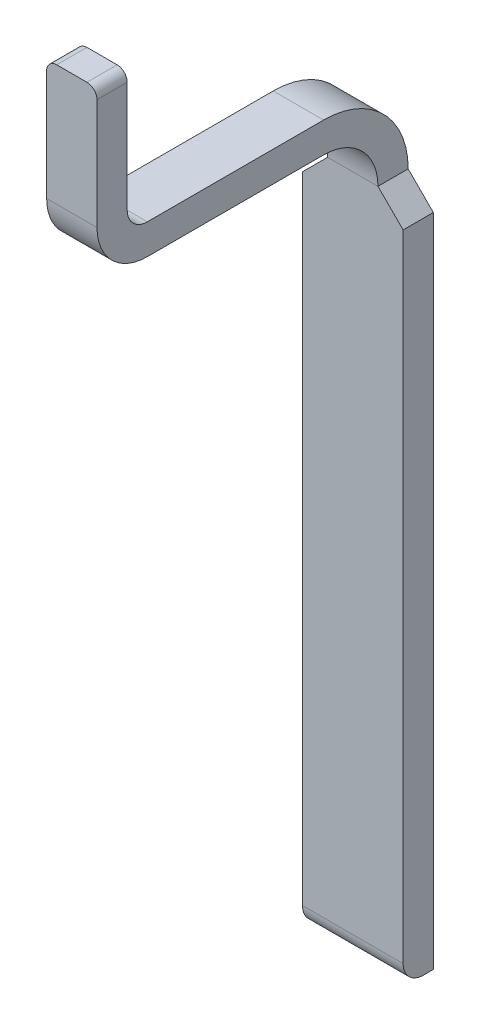
ISO-10303-21;
HEADER;
FILE_DESCRIPTION(('STEP AP214'),'2;1');
FILE_NAME('part.step','',(''),(''),'','','');
FILE_SCHEMA(('AUTOMOTIVE_DESIGN { 1 0 10303 214 1 1 1 1 }'));
ENDSEC;
DATA;
#1=APPLICATION_CONTEXT('core data for automotive mechanical design processes');
#2=APPLICATION_PROTOCOL_DEFINITION('international standard','automotive_design',2000,#1);
#3=PRODUCT_CONTEXT('',#1,'mechanical');
#4=PRODUCT('Part','Part','',(#3));
#5=PRODUCT_RELATED_PRODUCT_CATEGORY('part','',(#4));
#6=PRODUCT_DEFINITION_FORMATION('','',#4);
#7=PRODUCT_DEFINITION_CONTEXT('part definition',#1,'design');
#8=PRODUCT_DEFINITION('design','',#6,#7);
#9=PRODUCT_DEFINITION_SHAPE('','',#8);
#10=(LENGTH_UNIT() NAMED_UNIT(*) SI_UNIT(.MILLI.,.METRE.));
#11=(NAMED_UNIT(*) PLANE_ANGLE_UNIT() SI_UNIT($,.RADIAN.));
#12=(NAMED_UNIT(*) SI_UNIT($,.STERADIAN.) SOLID_ANGLE_UNIT());
#13=UNCERTAINTY_MEASURE_WITH_UNIT(LENGTH_MEASURE(1.E-05),#10,'distance_accuracy_value','');
#14=(GEOMETRIC_REPRESENTATION_CONTEXT(3) GLOBAL_UNCERTAINTY_ASSIGNED_CONTEXT((#13)) GLOBAL_UNIT_ASSIGNED_CONTEXT((#10,
#11,#12)) REPRESENTATION_CONTEXT('',''));
#15=CARTESIAN_POINT('',(0.,0.,0.));
#16=DIRECTION('',(0.,0.,1.));
#17=DIRECTION('',(1.,0.,0.));
#18=AXIS2_PLACEMENT_3D('',#15,#16,#17);
#19=CARTESIAN_POINT('',(-1.05,2.03,-0.12));
#20=DIRECTION('',(0.,0.,-1.));
#21=DIRECTION('',(-1.,0.,0.));
#22=AXIS2_PLACEMENT_3D('',#19,#20,#21);
#23=PLANE('',#22);
#24=DIRECTION('',(0.,-1.,0.));
#25=VECTOR('',#24,1.);
#26=CARTESIAN_POINT('',(-1.55,2.03,-0.12));
#27=LINE('',#26,#25);
#28=CARTESIAN_POINT('',(-1.55,1.905,-0.12));
#29=VERTEX_POINT('',#28);
#30=CARTESIAN_POINT('',(-1.55,-1.25,-0.120000000000002));
#31=VERTEX_POINT('',#30);
#32=EDGE_CURVE('E11',#29,#31,#27,.T.);
#33=ORIENTED_EDGE('',*,*,#32,.T.);
#34=DIRECTION('',(1.,0.,0.));
#35=VECTOR('',#34,1.);
#36=CARTESIAN_POINT('',(-1.05,-1.25,-0.120000000000002));
#37=LINE('',#36,#35);
#38=CARTESIAN_POINT('',(-1.05,-1.25,-0.120000000000002));
#39=VERTEX_POINT('',#38);
#40=EDGE_CURVE('E210',#31,#39,#37,.T.);
#41=ORIENTED_EDGE('',*,*,#40,.T.);
#42=DIRECTION('',(0.,-1.,0.));
#43=VECTOR('',#42,1.);
#44=CARTESIAN_POINT('',(-1.05,2.03,-0.12));
#45=LINE('',#44,#43);
#46=CARTESIAN_POINT('',(-1.05,1.905,-0.12));
#47=VERTEX_POINT('',#46);
#48=EDGE_CURVE('E27',#47,#39,#45,.T.);
#49=ORIENTED_EDGE('',*,*,#48,.F.);
#50=DIRECTION('',(-0.707106781186547,0.707106781186548,0.));
#51=VECTOR('',#50,1.);
#52=CARTESIAN_POINT('',(-1.05,1.905,-0.12));
#53=LINE('',#52,#51);
#54=CARTESIAN_POINT('',(-1.175,2.03,-0.12));
#55=VERTEX_POINT('',#54);
#56=EDGE_CURVE('E233',#47,#55,#53,.T.);
#57=ORIENTED_EDGE('',*,*,#56,.T.);
#58=DIRECTION('',(-1.,0.,0.));
#59=VECTOR('',#58,1.);
#60=CARTESIAN_POINT('',(-1.05,2.03,-0.12));
#61=LINE('',#60,#59);
#62=CARTESIAN_POINT('',(-1.425,2.03,-0.12));
#63=VERTEX_POINT('',#62);
#64=EDGE_CURVE('E218',#55,#63,#61,.T.);
#65=ORIENTED_EDGE('',*,*,#64,.T.);
#66=DIRECTION('',(-0.707106781186547,-0.707106781186548,0.));
#67=VECTOR('',#66,1.);
#68=CARTESIAN_POINT('',(-1.425,2.03,-0.12));
#69=LINE('',#68,#67);
#70=EDGE_CURVE('E241',#63,#29,#69,.T.);
#71=ORIENTED_EDGE('',*,*,#70,.T.);
#72=EDGE_LOOP('',(#33,#41,#49,#57,#65,#71));
#73=FACE_BOUND('',#72,.T.);
#74=ADVANCED_FACE('F16',(#73),#23,.F.);
#75=CARTESIAN_POINT('',(-1.55,-1.35,-0.27));
#76=DIRECTION('',(1.,0.,0.));
#77=DIRECTION('',(0.,-1.,0.));
#78=AXIS2_PLACEMENT_3D('',#75,#76,#77);
#79=PLANE('',#78);
#80=DIRECTION('',(0.,0.,-1.));
#81=VECTOR('',#80,1.);
#82=CARTESIAN_POINT('',(-1.55,-1.35,-0.120000000000002));
#83=LINE('',#82,#81);
#84=CARTESIAN_POINT('',(-1.55,-1.35,-0.22));
#85=VERTEX_POINT('',#84);
#86=CARTESIAN_POINT('',(-1.55,-1.35,-0.27));
#87=VERTEX_POINT('',#86);
#88=EDGE_CURVE('E148',#85,#87,#83,.T.);
#89=ORIENTED_EDGE('',*,*,#88,.F.);
#90=CARTESIAN_POINT('',(-1.55,-1.25,-0.22));
#91=DIRECTION('',(-1.,0.,0.));
#92=DIRECTION('',(0.,1.,0.));
#93=AXIS2_PLACEMENT_3D('',#90,#91,#92);
#94=CIRCLE('',#93,0.1);
#95=EDGE_CURVE('E207',#85,#31,#94,.T.);
#96=ORIENTED_EDGE('',*,*,#95,.T.);
#97=ORIENTED_EDGE('',*,*,#32,.F.);
#98=DIRECTION('',(0.,0.,-1.));
#99=VECTOR('',#98,1.);
#100=CARTESIAN_POINT('',(-1.55,1.905,-0.27));
#101=LINE('',#100,#99);
#102=CARTESIAN_POINT('',(-1.55,1.905,-0.27));
#103=VERTEX_POINT('',#102);
#104=EDGE_CURVE('E238',#29,#103,#101,.T.);
#105=ORIENTED_EDGE('',*,*,#104,.T.);
#106=DIRECTION('',(0.,1.,0.));
#107=VECTOR('',#106,1.);
#108=CARTESIAN_POINT('',(-1.55,-1.35,-0.27));
#109=LINE('',#108,#107);
#110=EDGE_CURVE('E253',#87,#103,#109,.T.);
#111=ORIENTED_EDGE('',*,*,#110,.F.);
#112=EDGE_LOOP('',(#89,#96,#97,#105,#111));
#113=FACE_BOUND('',#112,.T.);
#114=ADVANCED_FACE('F404',(#113),#79,.F.);
#115=CARTESIAN_POINT('',(-1.05,-1.35,-0.27));
#116=DIRECTION('',(1.,0.,0.));
#117=DIRECTION('',(0.,-1.,0.));
#118=AXIS2_PLACEMENT_3D('',#115,#116,#117);
#119=PLANE('',#118);
#120=ORIENTED_EDGE('',*,*,#48,.T.);
#121=CARTESIAN_POINT('',(-1.05,-1.25,-0.22));
#122=DIRECTION('',(1.,0.,0.));
#123=DIRECTION('',(0.,1.,0.));
#124=AXIS2_PLACEMENT_3D('',#121,#122,#123);
#125=CIRCLE('',#124,0.1);
#126=CARTESIAN_POINT('',(-1.05,-1.35,-0.22));
#127=VERTEX_POINT('',#126);
#128=EDGE_CURVE('E265',#39,#127,#125,.T.);
#129=ORIENTED_EDGE('',*,*,#128,.T.);
#130=DIRECTION('',(0.,0.,-1.));
#131=VECTOR('',#130,1.);
#132=CARTESIAN_POINT('',(-1.05,-1.35,-0.120000000000002));
#133=LINE('',#132,#131);
#134=CARTESIAN_POINT('',(-1.05,-1.35,-0.27));
#135=VERTEX_POINT('',#134);
#136=EDGE_CURVE('E274',#127,#135,#133,.T.);
#137=ORIENTED_EDGE('',*,*,#136,.T.);
#138=DIRECTION('',(0.,1.,0.));
#139=VECTOR('',#138,1.);
#140=CARTESIAN_POINT('',(-1.05,-1.35,-0.27));
#141=LINE('',#140,#139);
#142=CARTESIAN_POINT('',(-1.05,1.905,-0.27));
#143=VERTEX_POINT('',#142);
#144=EDGE_CURVE('E242',#135,#143,#141,.T.);
#145=ORIENTED_EDGE('',*,*,#144,.T.);
#146=DIRECTION('',(0.,0.,1.));
#147=VECTOR('',#146,1.);
#148=CARTESIAN_POINT('',(-1.05,1.905,-0.12));
#149=LINE('',#148,#147);
#150=EDGE_CURVE('E81',#143,#47,#149,.T.);
#151=ORIENTED_EDGE('',*,*,#150,.T.);
#152=EDGE_LOOP('',(#120,#129,#137,#145,#151));
#153=FACE_BOUND('',#152,.T.);
#154=ADVANCED_FACE('F418',(#153),#119,.T.);
#155=CARTESIAN_POINT('',(-1.175,2.03,0.149999999999998));
#156=DIRECTION('',(1.,0.,0.));
#157=DIRECTION('',(0.,0.,1.));
#158=AXIS2_PLACEMENT_3D('',#155,#156,#157);
#159=CYLINDRICAL_SURFACE('',#158,0.27);
#160=CARTESIAN_POINT('',(-1.425,2.03,0.149999999999998));
#161=DIRECTION('',(1.,0.,0.));
#162=DIRECTION('',(0.,-1.,0.));
#163=AXIS2_PLACEMENT_3D('',#160,#161,#162);
#164=CIRCLE('',#163,0.27);
#165=CARTESIAN_POINT('',(-1.425,2.3,0.149999999999998));
#166=VERTEX_POINT('',#165);
#167=EDGE_CURVE('E298',#63,#166,#164,.T.);
#168=ORIENTED_EDGE('',*,*,#167,.F.);
#169=ORIENTED_EDGE('',*,*,#64,.F.);
#170=CARTESIAN_POINT('',(-1.175,2.03,0.149999999999998));
#171=DIRECTION('',(1.,0.,0.));
#172=DIRECTION('',(0.,-1.,0.));
#173=AXIS2_PLACEMENT_3D('',#170,#171,#172);
#174=CIRCLE('',#173,0.27);
#175=CARTESIAN_POINT('',(-1.175,2.3,0.149999999999998));
#176=VERTEX_POINT('',#175);
#177=EDGE_CURVE('E191',#55,#176,#174,.T.);
#178=ORIENTED_EDGE('',*,*,#177,.T.);
#179=DIRECTION('',(-1.,0.,0.));
#180=VECTOR('',#179,1.);
#181=CARTESIAN_POINT('',(-1.175,2.3,0.149999999999998));
#182=LINE('',#181,#180);
#183=EDGE_CURVE('E181',#176,#166,#182,.T.);
#184=ORIENTED_EDGE('',*,*,#183,.T.);
#185=EDGE_LOOP('',(#168,#169,#178,#184));
#186=FACE_BOUND('',#185,.T.);
#187=ADVANCED_FACE('F18',(#186),#159,.F.);
#188=CARTESIAN_POINT('',(-1.175,2.3,0.149999999999998));
#189=DIRECTION('',(0.,-1.,0.));
#190=DIRECTION('',(0.,0.,-1.));
#191=AXIS2_PLACEMENT_3D('',#188,#189,#190);
#192=PLANE('',#191);
#193=DIRECTION('',(0.,0.,1.));
#194=VECTOR('',#193,1.);
#195=CARTESIAN_POINT('',(-1.425,2.3,0.149999999999998));
#196=LINE('',#195,#194);
#197=CARTESIAN_POINT('',(-1.425,2.3,1.025));
#198=VERTEX_POINT('',#197);
#199=EDGE_CURVE('E302',#166,#198,#196,.T.);
#200=ORIENTED_EDGE('',*,*,#199,.F.);
#201=ORIENTED_EDGE('',*,*,#183,.F.);
#202=DIRECTION('',(0.,0.,1.));
#203=VECTOR('',#202,1.);
#204=CARTESIAN_POINT('',(-1.175,2.3,0.149999999999998));
#205=LINE('',#204,#203);
#206=CARTESIAN_POINT('',(-1.175,2.3,1.025));
#207=VERTEX_POINT('',#206);
#208=EDGE_CURVE('E185',#176,#207,#205,.T.);
#209=ORIENTED_EDGE('',*,*,#208,.T.);
#210=DIRECTION('',(-1.,0.,0.));
#211=VECTOR('',#210,1.);
#212=CARTESIAN_POINT('',(-1.175,2.3,1.025));
#213=LINE('',#212,#211);
#214=EDGE_CURVE('E168',#207,#198,#213,.T.);
#215=ORIENTED_EDGE('',*,*,#214,.T.);
#216=EDGE_LOOP('',(#200,#201,#209,#215));
#217=FACE_BOUND('',#216,.T.);
#218=ADVANCED_FACE('F186',(#217),#192,.T.);
#219=CARTESIAN_POINT('',(-1.175,2.55,1.025));
#220=DIRECTION('',(1.,0.,0.));
#221=DIRECTION('',(0.,0.,1.));
#222=AXIS2_PLACEMENT_3D('',#219,#220,#221);
#223=CYLINDRICAL_SURFACE('',#222,0.25);
#224=CARTESIAN_POINT('',(-1.425,2.55,1.025));
#225=DIRECTION('',(-1.,0.,0.));
#226=DIRECTION('',(0.,1.,0.));
#227=AXIS2_PLACEMENT_3D('',#224,#225,#226);
#228=CIRCLE('',#227,0.25);
#229=CARTESIAN_POINT('',(-1.425,2.55,1.275));
#230=VERTEX_POINT('',#229);
#231=EDGE_CURVE('E176',#198,#230,#228,.T.);
#232=ORIENTED_EDGE('',*,*,#231,.F.);
#233=ORIENTED_EDGE('',*,*,#214,.F.);
#234=CARTESIAN_POINT('',(-1.175,2.55,1.025));
#235=DIRECTION('',(-1.,0.,0.));
#236=DIRECTION('',(0.,1.,0.));
#237=AXIS2_PLACEMENT_3D('',#234,#235,#236);
#238=CIRCLE('',#237,0.25);
#239=CARTESIAN_POINT('',(-1.175,2.55,1.275));
#240=VERTEX_POINT('',#239);
#241=EDGE_CURVE('E173',#207,#240,#238,.T.);
#242=ORIENTED_EDGE('',*,*,#241,.T.);
#243=DIRECTION('',(-1.,0.,0.));
#244=VECTOR('',#243,1.);
#245=CARTESIAN_POINT('',(-1.175,2.55,1.275));
#246=LINE('',#245,#244);
#247=EDGE_CURVE('E182',#240,#230,#246,.T.);
#248=ORIENTED_EDGE('',*,*,#247,.T.);
#249=EDGE_LOOP('',(#232,#233,#242,#248));
#250=FACE_BOUND('',#249,.T.);
#251=ADVANCED_FACE('F170',(#250),#223,.T.);
#252=CARTESIAN_POINT('',(-1.175,2.55,1.275));
#253=DIRECTION('',(0.,0.,1.));
#254=DIRECTION('',(0.,-1.,0.));
#255=AXIS2_PLACEMENT_3D('',#252,#253,#254);
#256=PLANE('',#255);
#257=DIRECTION('',(0.,1.,0.));
#258=VECTOR('',#257,1.);
#259=CARTESIAN_POINT('',(-1.175,2.55,1.275));
#260=LINE('',#259,#258);
#261=CARTESIAN_POINT('',(-1.175,3.1,1.275));
#262=VERTEX_POINT('',#261);
#263=EDGE_CURVE('E195',#240,#262,#260,.T.);
#264=ORIENTED_EDGE('',*,*,#263,.T.);
#265=CARTESIAN_POINT('',(-1.225,3.1,1.275));
#266=DIRECTION('',(0.,0.,1.));
#267=DIRECTION('',(0.,-1.,0.));
#268=AXIS2_PLACEMENT_3D('',#265,#266,#267);
#269=CIRCLE('',#268,0.05);
#270=CARTESIAN_POINT('',(-1.225,3.15,1.275));
#271=VERTEX_POINT('',#270);
#272=EDGE_CURVE('E271',#262,#271,#269,.T.);
#273=ORIENTED_EDGE('',*,*,#272,.T.);
#274=DIRECTION('',(-1.,0.,0.));
#275=VECTOR('',#274,1.);
#276=CARTESIAN_POINT('',(-1.175,3.15,1.275));
#277=LINE('',#276,#275);
#278=CARTESIAN_POINT('',(-1.375,3.15,1.275));
#279=VERTEX_POINT('',#278);
#280=EDGE_CURVE('E229',#271,#279,#277,.T.);
#281=ORIENTED_EDGE('',*,*,#280,.T.);
#282=CARTESIAN_POINT('',(-1.375,3.1,1.275));
#283=DIRECTION('',(0.,0.,1.));
#284=DIRECTION('',(0.,-1.,0.));
#285=AXIS2_PLACEMENT_3D('',#282,#283,#284);
#286=CIRCLE('',#285,0.05);
#287=CARTESIAN_POINT('',(-1.425,3.1,1.275));
#288=VERTEX_POINT('',#287);
#289=EDGE_CURVE('E220',#279,#288,#286,.T.);
#290=ORIENTED_EDGE('',*,*,#289,.T.);
#291=DIRECTION('',(0.,1.,0.));
#292=VECTOR('',#291,1.);
#293=CARTESIAN_POINT('',(-1.425,2.55,1.275));
#294=LINE('',#293,#292);
#295=EDGE_CURVE('E313',#230,#288,#294,.T.);
#296=ORIENTED_EDGE('',*,*,#295,.F.);
#297=ORIENTED_EDGE('',*,*,#247,.F.);
#298=EDGE_LOOP('',(#264,#273,#281,#290,#296,#297));
#299=FACE_BOUND('',#298,.T.);
#300=ADVANCED_FACE('F370',(#299),#256,.T.);
#301=CARTESIAN_POINT('',(-1.175,3.15,1.275));
#302=DIRECTION('',(0.,1.,0.));
#303=DIRECTION('',(1.,0.,0.));
#304=AXIS2_PLACEMENT_3D('',#301,#302,#303);
#305=PLANE('',#304);
#306=ORIENTED_EDGE('',*,*,#280,.F.);
#307=DIRECTION('',(0.,0.,-1.));
#308=VECTOR('',#307,1.);
#309=CARTESIAN_POINT('',(-1.225,3.15,1.275));
#310=LINE('',#309,#308);
#311=CARTESIAN_POINT('',(-1.225,3.15,1.125));
#312=VERTEX_POINT('',#311);
#313=EDGE_CURVE('E251',#271,#312,#310,.T.);
#314=ORIENTED_EDGE('',*,*,#313,.T.);
#315=DIRECTION('',(-1.,0.,0.));
#316=VECTOR('',#315,1.);
#317=CARTESIAN_POINT('',(-1.175,3.15,1.125));
#318=LINE('',#317,#316);
#319=CARTESIAN_POINT('',(-1.375,3.15,1.125));
#320=VERTEX_POINT('',#319);
#321=EDGE_CURVE('E232',#312,#320,#318,.T.);
#322=ORIENTED_EDGE('',*,*,#321,.T.);
#323=DIRECTION('',(0.,0.,1.));
#324=VECTOR('',#323,1.);
#325=CARTESIAN_POINT('',(-1.375,3.15,1.275));
#326=LINE('',#325,#324);
#327=EDGE_CURVE('E224',#320,#279,#326,.T.);
#328=ORIENTED_EDGE('',*,*,#327,.T.);
#329=EDGE_LOOP('',(#306,#314,#322,#328));
#330=FACE_BOUND('',#329,.T.);
#331=ADVANCED_FACE('F360',(#330),#305,.T.);
#332=CARTESIAN_POINT('',(-1.175,2.55,1.125));
#333=DIRECTION('',(0.,0.,-1.));
#334=DIRECTION('',(0.,-1.,0.));
#335=AXIS2_PLACEMENT_3D('',#332,#333,#334);
#336=PLANE('',#335);
#337=ORIENTED_EDGE('',*,*,#321,.F.);
#338=CARTESIAN_POINT('',(-1.225,3.1,1.125));
#339=DIRECTION('',(0.,0.,-1.));
#340=DIRECTION('',(0.,1.,0.));
#341=AXIS2_PLACEMENT_3D('',#338,#339,#340);
#342=CIRCLE('',#341,0.05);
#343=CARTESIAN_POINT('',(-1.175,3.1,1.125));
#344=VERTEX_POINT('',#343);
#345=EDGE_CURVE('E247',#312,#344,#342,.T.);
#346=ORIENTED_EDGE('',*,*,#345,.T.);
#347=DIRECTION('',(0.,-1.,0.));
#348=VECTOR('',#347,1.);
#349=CARTESIAN_POINT('',(-1.175,2.55,1.125));
#350=LINE('',#349,#348);
#351=CARTESIAN_POINT('',(-1.175,2.55,1.125));
#352=VERTEX_POINT('',#351);
#353=EDGE_CURVE('E202',#344,#352,#350,.T.);
#354=ORIENTED_EDGE('',*,*,#353,.T.);
#355=DIRECTION('',(-1.,0.,0.));
#356=VECTOR('',#355,1.);
#357=CARTESIAN_POINT('',(-1.175,2.55,1.125));
#358=LINE('',#357,#356);
#359=CARTESIAN_POINT('',(-1.425,2.55,1.125));
#360=VERTEX_POINT('',#359);
#361=EDGE_CURVE('E227',#352,#360,#358,.T.);
#362=ORIENTED_EDGE('',*,*,#361,.T.);
#363=DIRECTION('',(0.,-1.,0.));
#364=VECTOR('',#363,1.);
#365=CARTESIAN_POINT('',(-1.425,2.55,1.125));
#366=LINE('',#365,#364);
#367=CARTESIAN_POINT('',(-1.425,3.1,1.125));
#368=VERTEX_POINT('',#367);
#369=EDGE_CURVE('E261',#368,#360,#366,.T.);
#370=ORIENTED_EDGE('',*,*,#369,.F.);
#371=CARTESIAN_POINT('',(-1.375,3.1,1.125));
#372=DIRECTION('',(0.,0.,-1.));
#373=DIRECTION('',(0.,1.,0.));
#374=AXIS2_PLACEMENT_3D('',#371,#372,#373);
#375=CIRCLE('',#374,0.05);
#376=EDGE_CURVE('E342',#368,#320,#375,.T.);
#377=ORIENTED_EDGE('',*,*,#376,.T.);
#378=EDGE_LOOP('',(#337,#346,#354,#362,#370,#377));
#379=FACE_BOUND('',#378,.T.);
#380=ADVANCED_FACE('F429',(#379),#336,.T.);
#381=CARTESIAN_POINT('',(-1.175,2.55,1.025));
#382=DIRECTION('',(1.,0.,0.));
#383=DIRECTION('',(0.,0.,1.));
#384=AXIS2_PLACEMENT_3D('',#381,#382,#383);
#385=CYLINDRICAL_SURFACE('',#384,0.1);
#386=CARTESIAN_POINT('',(-1.425,2.55,1.025));
#387=DIRECTION('',(1.,0.,0.));
#388=DIRECTION('',(0.,1.,0.));
#389=AXIS2_PLACEMENT_3D('',#386,#387,#388);
#390=CIRCLE('',#389,0.1);
#391=CARTESIAN_POINT('',(-1.425,2.45,1.025));
#392=VERTEX_POINT('',#391);
#393=EDGE_CURVE('E216',#360,#392,#390,.T.);
#394=ORIENTED_EDGE('',*,*,#393,.F.);
#395=ORIENTED_EDGE('',*,*,#361,.F.);
#396=CARTESIAN_POINT('',(-1.175,2.55,1.025));
#397=DIRECTION('',(1.,0.,0.));
#398=DIRECTION('',(0.,1.,0.));
#399=AXIS2_PLACEMENT_3D('',#396,#397,#398);
#400=CIRCLE('',#399,0.1);
#401=CARTESIAN_POINT('',(-1.175,2.45,1.025));
#402=VERTEX_POINT('',#401);
#403=EDGE_CURVE('E228',#352,#402,#400,.T.);
#404=ORIENTED_EDGE('',*,*,#403,.T.);
#405=DIRECTION('',(-1.,0.,0.));
#406=VECTOR('',#405,1.);
#407=CARTESIAN_POINT('',(-1.175,2.45,1.025));
#408=LINE('',#407,#406);
#409=EDGE_CURVE('E40',#402,#392,#408,.T.);
#410=ORIENTED_EDGE('',*,*,#409,.T.);
#411=EDGE_LOOP('',(#394,#395,#404,#410));
#412=FACE_BOUND('',#411,.T.);
#413=ADVANCED_FACE('F510',(#412),#385,.F.);
#414=CARTESIAN_POINT('',(-1.175,2.45,0.149999999999998));
#415=DIRECTION('',(0.,1.,0.));
#416=DIRECTION('',(1.,0.,0.));
#417=AXIS2_PLACEMENT_3D('',#414,#415,#416);
#418=PLANE('',#417);
#419=DIRECTION('',(0.,0.,-1.));
#420=VECTOR('',#419,1.);
#421=CARTESIAN_POINT('',(-1.425,2.45,0.149999999999998));
#422=LINE('',#421,#420);
#423=CARTESIAN_POINT('',(-1.425,2.45,0.149999999999998));
#424=VERTEX_POINT('',#423);
#425=EDGE_CURVE('E211',#392,#424,#422,.T.);
#426=ORIENTED_EDGE('',*,*,#425,.F.);
#427=ORIENTED_EDGE('',*,*,#409,.F.);
#428=DIRECTION('',(0.,0.,-1.));
#429=VECTOR('',#428,1.);
#430=CARTESIAN_POINT('',(-1.175,2.45,0.149999999999998));
#431=LINE('',#430,#429);
#432=CARTESIAN_POINT('',(-1.175,2.45,0.149999999999998));
#433=VERTEX_POINT('',#432);
#434=EDGE_CURVE('E280',#402,#433,#431,.T.);
#435=ORIENTED_EDGE('',*,*,#434,.T.);
#436=DIRECTION('',(-1.,0.,0.));
#437=VECTOR('',#436,1.);
#438=CARTESIAN_POINT('',(-1.175,2.45,0.149999999999998));
#439=LINE('',#438,#437);
#440=EDGE_CURVE('E246',#433,#424,#439,.T.);
#441=ORIENTED_EDGE('',*,*,#440,.T.);
#442=EDGE_LOOP('',(#426,#427,#435,#441));
#443=FACE_BOUND('',#442,.T.);
#444=ADVANCED_FACE('F457',(#443),#418,.T.);
#445=CARTESIAN_POINT('',(-1.175,2.03,0.149999999999998));
#446=DIRECTION('',(1.,0.,0.));
#447=DIRECTION('',(0.,-1.,0.));
#448=AXIS2_PLACEMENT_3D('',#445,#446,#447);
#449=PLANE('',#448);
#450=ORIENTED_EDGE('',*,*,#353,.F.);
#451=DIRECTION('',(0.,0.,1.));
#452=VECTOR('',#451,1.);
#453=CARTESIAN_POINT('',(-1.175,3.1,0.149999999999998));
#454=LINE('',#453,#452);
#455=EDGE_CURVE('E252',#344,#262,#454,.T.);
#456=ORIENTED_EDGE('',*,*,#455,.T.);
#457=ORIENTED_EDGE('',*,*,#263,.F.);
#458=ORIENTED_EDGE('',*,*,#241,.F.);
#459=ORIENTED_EDGE('',*,*,#208,.F.);
#460=ORIENTED_EDGE('',*,*,#177,.F.);
#461=DIRECTION('',(0.,0.,-1.));
#462=VECTOR('',#461,1.);
#463=CARTESIAN_POINT('',(-1.175,2.03,-0.27));
#464=LINE('',#463,#462);
#465=CARTESIAN_POINT('',(-1.175,2.03,-0.27));
#466=VERTEX_POINT('',#465);
#467=EDGE_CURVE('E237',#55,#466,#464,.T.);
#468=ORIENTED_EDGE('',*,*,#467,.T.);
#469=CARTESIAN_POINT('',(-1.175,2.03,0.149999999999998));
#470=DIRECTION('',(-1.,0.,0.));
#471=DIRECTION('',(0.,-1.,0.));
#472=AXIS2_PLACEMENT_3D('',#469,#470,#471);
#473=CIRCLE('',#472,0.42);
#474=EDGE_CURVE('E98',#433,#466,#473,.T.);
#475=ORIENTED_EDGE('',*,*,#474,.F.);
#476=ORIENTED_EDGE('',*,*,#434,.F.);
#477=ORIENTED_EDGE('',*,*,#403,.F.);
#478=EDGE_LOOP('',(#450,#456,#457,#458,#459,#460,#468,#475,#476,#477));
#479=FACE_BOUND('',#478,.T.);
#480=ADVANCED_FACE('F193',(#479),#449,.T.);
#481=CARTESIAN_POINT('',(-1.175,2.03,0.149999999999998));
#482=DIRECTION('',(1.,0.,0.));
#483=DIRECTION('',(0.,0.,1.));
#484=AXIS2_PLACEMENT_3D('',#481,#482,#483);
#485=CYLINDRICAL_SURFACE('',#484,0.42);
#486=CARTESIAN_POINT('',(-1.425,2.03,0.149999999999998));
#487=DIRECTION('',(-1.,0.,0.));
#488=DIRECTION('',(0.,-1.,0.));
#489=AXIS2_PLACEMENT_3D('',#486,#487,#488);
#490=CIRCLE('',#489,0.42);
#491=CARTESIAN_POINT('',(-1.425,2.03,-0.27));
#492=VERTEX_POINT('',#491);
#493=EDGE_CURVE('E215',#424,#492,#490,.T.);
#494=ORIENTED_EDGE('',*,*,#493,.F.);
#495=ORIENTED_EDGE('',*,*,#440,.F.);
#496=ORIENTED_EDGE('',*,*,#474,.T.);
#497=DIRECTION('',(-1.,0.,0.));
#498=VECTOR('',#497,1.);
#499=CARTESIAN_POINT('',(-1.05,2.03,-0.27));
#500=LINE('',#499,#498);
#501=EDGE_CURVE('E286',#466,#492,#500,.T.);
#502=ORIENTED_EDGE('',*,*,#501,.T.);
#503=EDGE_LOOP('',(#494,#495,#496,#502));
#504=FACE_BOUND('',#503,.T.);
#505=ADVANCED_FACE('F456',(#504),#485,.T.);
#506=CARTESIAN_POINT('',(-1.425,2.03,0.149999999999998));
#507=DIRECTION('',(1.,0.,0.));
#508=DIRECTION('',(0.,-1.,0.));
#509=AXIS2_PLACEMENT_3D('',#506,#507,#508);
#510=PLANE('',#509);
#511=ORIENTED_EDGE('',*,*,#295,.T.);
#512=DIRECTION('',(0.,0.,-1.));
#513=VECTOR('',#512,1.);
#514=CARTESIAN_POINT('',(-1.425,3.1,1.125));
#515=LINE('',#514,#513);
#516=EDGE_CURVE('E20',#288,#368,#515,.T.);
#517=ORIENTED_EDGE('',*,*,#516,.T.);
#518=ORIENTED_EDGE('',*,*,#369,.T.);
#519=ORIENTED_EDGE('',*,*,#393,.T.);
#520=ORIENTED_EDGE('',*,*,#425,.T.);
#521=ORIENTED_EDGE('',*,*,#493,.T.);
#522=DIRECTION('',(0.,0.,1.));
#523=VECTOR('',#522,1.);
#524=CARTESIAN_POINT('',(-1.425,2.03,-0.27));
#525=LINE('',#524,#523);
#526=EDGE_CURVE('E324',#492,#63,#525,.T.);
#527=ORIENTED_EDGE('',*,*,#526,.T.);
#528=ORIENTED_EDGE('',*,*,#167,.T.);
#529=ORIENTED_EDGE('',*,*,#199,.T.);
#530=ORIENTED_EDGE('',*,*,#231,.T.);
#531=EDGE_LOOP('',(#511,#517,#518,#519,#520,#521,#527,#528,#529,#530));
#532=FACE_BOUND('',#531,.T.);
#533=ADVANCED_FACE('F373',(#532),#510,.F.);
#534=CARTESIAN_POINT('',(-1.375,3.1,0.149999999999998));
#535=DIRECTION('',(0.,0.,-1.));
#536=DIRECTION('',(1.,0.,0.));
#537=AXIS2_PLACEMENT_3D('',#534,#535,#536);
#538=CYLINDRICAL_SURFACE('',#537,0.05);
#539=ORIENTED_EDGE('',*,*,#289,.F.);
#540=ORIENTED_EDGE('',*,*,#327,.F.);
#541=ORIENTED_EDGE('',*,*,#376,.F.);
#542=ORIENTED_EDGE('',*,*,#516,.F.);
#543=EDGE_LOOP('',(#539,#540,#541,#542));
#544=FACE_BOUND('',#543,.T.);
#545=ADVANCED_FACE('F366',(#544),#538,.T.);
#546=CARTESIAN_POINT('',(-1.05,1.905,-0.27));
#547=DIRECTION('',(0.707106781186548,0.707106781186547,0.));
#548=DIRECTION('',(0.,0.,-1.));
#549=AXIS2_PLACEMENT_3D('',#546,#547,#548);
#550=PLANE('',#549);
#551=DIRECTION('',(0.707106781186547,-0.707106781186548,0.));
#552=VECTOR('',#551,1.);
#553=CARTESIAN_POINT('',(-1.05,1.905,-0.27));
#554=LINE('',#553,#552);
#555=EDGE_CURVE('E264',#466,#143,#554,.T.);
#556=ORIENTED_EDGE('',*,*,#555,.F.);
#557=ORIENTED_EDGE('',*,*,#467,.F.);
#558=ORIENTED_EDGE('',*,*,#56,.F.);
#559=ORIENTED_EDGE('',*,*,#150,.F.);
#560=EDGE_LOOP('',(#556,#557,#558,#559));
#561=FACE_BOUND('',#560,.T.);
#562=ADVANCED_FACE('F481',(#561),#550,.T.);
#563=CARTESIAN_POINT('',(-1.425,2.03,-0.27));
#564=DIRECTION('',(0.707106781186548,-0.707106781186547,0.));
#565=DIRECTION('',(0.,0.,-1.));
#566=AXIS2_PLACEMENT_3D('',#563,#564,#565);
#567=PLANE('',#566);
#568=DIRECTION('',(0.707106781186547,0.707106781186548,0.));
#569=VECTOR('',#568,1.);
#570=CARTESIAN_POINT('',(-1.425,2.03,-0.27));
#571=LINE('',#570,#569);
#572=EDGE_CURVE('E257',#103,#492,#571,.T.);
#573=ORIENTED_EDGE('',*,*,#572,.F.);
#574=ORIENTED_EDGE('',*,*,#104,.F.);
#575=ORIENTED_EDGE('',*,*,#70,.F.);
#576=ORIENTED_EDGE('',*,*,#526,.F.);
#577=EDGE_LOOP('',(#573,#574,#575,#576));
#578=FACE_BOUND('',#577,.T.);
#579=ADVANCED_FACE('F403',(#578),#567,.F.);
#580=CARTESIAN_POINT('',(-1.05,-1.35,-0.27));
#581=DIRECTION('',(0.,0.,1.));
#582=DIRECTION('',(0.,-1.,0.));
#583=AXIS2_PLACEMENT_3D('',#580,#581,#582);
#584=PLANE('',#583);
#585=ORIENTED_EDGE('',*,*,#110,.T.);
#586=ORIENTED_EDGE('',*,*,#572,.T.);
#587=ORIENTED_EDGE('',*,*,#501,.F.);
#588=ORIENTED_EDGE('',*,*,#555,.T.);
#589=ORIENTED_EDGE('',*,*,#144,.F.);
#590=DIRECTION('',(-1.,0.,0.));
#591=VECTOR('',#590,1.);
#592=CARTESIAN_POINT('',(-1.05,-1.35,-0.27));
#593=LINE('',#592,#591);
#594=EDGE_CURVE('E206',#135,#87,#593,.T.);
#595=ORIENTED_EDGE('',*,*,#594,.T.);
#596=EDGE_LOOP('',(#585,#586,#587,#588,#589,#595));
#597=FACE_BOUND('',#596,.T.);
#598=ADVANCED_FACE('F494',(#597),#584,.F.);
#599=CARTESIAN_POINT('',(-1.05,-1.35,-0.120000000000002));
#600=DIRECTION('',(0.,1.,0.));
#601=DIRECTION('',(1.,0.,0.));
#602=AXIS2_PLACEMENT_3D('',#599,#600,#601);
#603=PLANE('',#602);
#604=ORIENTED_EDGE('',*,*,#136,.F.);
#605=DIRECTION('',(-1.,0.,0.));
#606=VECTOR('',#605,1.);
#607=CARTESIAN_POINT('',(-1.05,-1.35,-0.22));
#608=LINE('',#607,#606);
#609=EDGE_CURVE('E209',#127,#85,#608,.T.);
#610=ORIENTED_EDGE('',*,*,#609,.T.);
#611=ORIENTED_EDGE('',*,*,#88,.T.);
#612=ORIENTED_EDGE('',*,*,#594,.F.);
#613=EDGE_LOOP('',(#604,#610,#611,#612));
#614=FACE_BOUND('',#613,.T.);
#615=ADVANCED_FACE('F520',(#614),#603,.F.);
#616=CARTESIAN_POINT('',(-1.225,3.1,1.275));
#617=DIRECTION('',(0.,0.,1.));
#618=DIRECTION('',(-1.,0.,0.));
#619=AXIS2_PLACEMENT_3D('',#616,#617,#618);
#620=CYLINDRICAL_SURFACE('',#619,0.05);
#621=ORIENTED_EDGE('',*,*,#272,.F.);
#622=ORIENTED_EDGE('',*,*,#455,.F.);
#623=ORIENTED_EDGE('',*,*,#345,.F.);
#624=ORIENTED_EDGE('',*,*,#313,.F.);
#625=EDGE_LOOP('',(#621,#622,#623,#624));
#626=FACE_BOUND('',#625,.T.);
#627=ADVANCED_FACE('F530',(#626),#620,.T.);
#628=CARTESIAN_POINT('',(-1.05,-1.25,-0.22));
#629=DIRECTION('',(1.,0.,0.));
#630=DIRECTION('',(0.,0.,1.));
#631=AXIS2_PLACEMENT_3D('',#628,#629,#630);
#632=CYLINDRICAL_SURFACE('',#631,0.1);
#633=ORIENTED_EDGE('',*,*,#128,.F.);
#634=ORIENTED_EDGE('',*,*,#40,.F.);
#635=ORIENTED_EDGE('',*,*,#95,.F.);
#636=ORIENTED_EDGE('',*,*,#609,.F.);
#637=EDGE_LOOP('',(#633,#634,#635,#636));
#638=FACE_BOUND('',#637,.T.);
#639=ADVANCED_FACE('F540',(#638),#632,.T.);
#640=CLOSED_SHELL('',(#74,#114,#154,#187,#218,#251,#300,#331,#380,#413,#444,#480,#505,#533,#545,
#562,#579,#598,#615,#627,#639));
#641=MANIFOLD_SOLID_BREP('B1',#640);
#642=ADVANCED_BREP_SHAPE_REPRESENTATION('',(#18,#641),#14);
#643=SHAPE_DEFINITION_REPRESENTATION(#9,#642);
ENDSEC;
END-ISO-10303-21;
